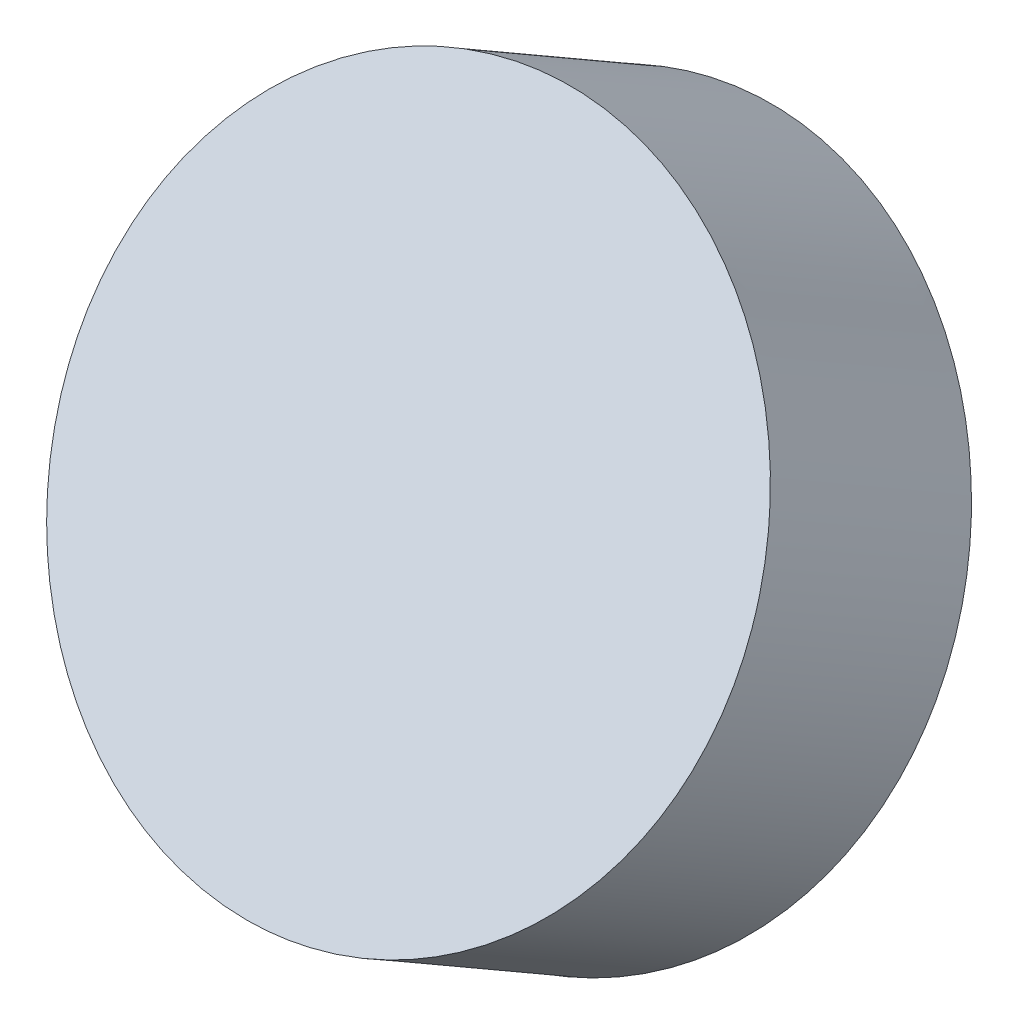
ISO-10303-21;
HEADER;
FILE_DESCRIPTION(('STEP AP214'),'2;1');
FILE_NAME('part.step','',(''),(''),'','','');
FILE_SCHEMA(('AUTOMOTIVE_DESIGN { 1 0 10303 214 1 1 1 1 }'));
ENDSEC;
DATA;
#1=APPLICATION_CONTEXT('core data for automotive mechanical design processes');
#2=APPLICATION_PROTOCOL_DEFINITION('international standard','automotive_design',2000,#1);
#3=PRODUCT_CONTEXT('',#1,'mechanical');
#4=PRODUCT('Part','Part','',(#3));
#5=PRODUCT_RELATED_PRODUCT_CATEGORY('part','',(#4));
#6=PRODUCT_DEFINITION_FORMATION('','',#4);
#7=PRODUCT_DEFINITION_CONTEXT('part definition',#1,'design');
#8=PRODUCT_DEFINITION('design','',#6,#7);
#9=PRODUCT_DEFINITION_SHAPE('','',#8);
#10=(LENGTH_UNIT() NAMED_UNIT(*) SI_UNIT(.MILLI.,.METRE.));
#11=(NAMED_UNIT(*) PLANE_ANGLE_UNIT() SI_UNIT($,.RADIAN.));
#12=(NAMED_UNIT(*) SI_UNIT($,.STERADIAN.) SOLID_ANGLE_UNIT());
#13=UNCERTAINTY_MEASURE_WITH_UNIT(LENGTH_MEASURE(1.E-05),#10,'distance_accuracy_value','');
#14=(GEOMETRIC_REPRESENTATION_CONTEXT(3) GLOBAL_UNCERTAINTY_ASSIGNED_CONTEXT((#13)) GLOBAL_UNIT_ASSIGNED_CONTEXT((#10,
#11,#12)) REPRESENTATION_CONTEXT('',''));
#15=CARTESIAN_POINT('',(0.,0.,0.));
#16=DIRECTION('',(0.,0.,1.));
#17=DIRECTION('',(1.,0.,0.));
#18=AXIS2_PLACEMENT_3D('',#15,#16,#17);
#19=CARTESIAN_POINT('',(12.5,-11.0000300449403,53.9329745870571));
#20=CARTESIAN_POINT('',(12.6682299792076,-11.0000300449403,53.9329745870571));
#21=CARTESIAN_POINT('',(13.0046899376229,-10.9420703881874,53.8995115636287));
#22=CARTESIAN_POINT('',(13.4325454072684,-10.6944876813019,53.7565696211617));
#23=CARTESIAN_POINT('',(13.7184292922025,-10.3239539754408,53.5426418863389));
#24=CARTESIAN_POINT('',(13.8188183624877,-9.88687966842495,53.2902969175275));
#25=CARTESIAN_POINT('',(13.7184292922025,-9.44980536140913,53.037951948716));
#26=CARTESIAN_POINT('',(13.4325454072684,-9.07927165554801,52.8240242138933));
#27=CARTESIAN_POINT('',(13.0046899376229,-8.83168894866253,52.6810822714262));
#28=CARTESIAN_POINT('',(12.5,-8.74474946353318,52.6308877362836));
#29=CARTESIAN_POINT('',(11.9953100623771,-8.83168894866253,52.6810822714262));
#30=CARTESIAN_POINT('',(11.5674545927316,-9.07927165554801,52.8240242138933));
#31=CARTESIAN_POINT('',(11.2815707077975,-9.44980536140913,53.037951948716));
#32=CARTESIAN_POINT('',(11.1811816375123,-9.88687966842495,53.2902969175275));
#33=CARTESIAN_POINT('',(11.2815707077975,-10.3239539754408,53.5426418863389));
#34=CARTESIAN_POINT('',(11.5674545927316,-10.6944876813019,53.7565696211617));
#35=CARTESIAN_POINT('',(11.9953100623771,-10.9420703881874,53.8995115636287));
#36=CARTESIAN_POINT('',(12.3317700207924,-11.0000300449403,53.9329745870571));
#37=CARTESIAN_POINT('',(12.5,-11.0000300449403,53.9329745870571));
#38=B_SPLINE_CURVE_WITH_KNOTS('',3,(#19,#20,#21,#22,#23,#24,#25,#26,#27,#28,#29,#30,#31,#32,#33,
#34,#35,#36,#37),.UNSPECIFIED.,.T.,.F.,(4,1,1,1,1,1,1,1,1,1,1,1,1,1,1,1,4),(0.,
0.0624999999999999,0.124999999999999,0.1875,0.25,0.3125,0.375,0.4375,0.499999999999999,0.5625,
0.625,0.687499999999999,0.75,0.8125,0.875,0.9375,1.),.UNSPECIFIED.);
#39=DIRECTION('',(0.,0.5,0.866025403784438));
#40=VECTOR('',#39,1.);
#41=SURFACE_OF_LINEAR_EXTRUSION('',#38,#40);
#42=CARTESIAN_POINT('',(12.5,-11.0000300449403,53.9329745870571));
#43=CARTESIAN_POINT('',(12.6682299792076,-11.0000300449403,53.9329745870571));
#44=CARTESIAN_POINT('',(13.0046899376229,-10.9420703881874,53.8995115636287));
#45=CARTESIAN_POINT('',(13.4325454072684,-10.6944876813019,53.7565696211617));
#46=CARTESIAN_POINT('',(13.7184292922025,-10.3239539754408,53.5426418863389));
#47=CARTESIAN_POINT('',(13.8188183624877,-9.88687966842495,53.2902969175275));
#48=CARTESIAN_POINT('',(13.7184292922025,-9.44980536140913,53.037951948716));
#49=CARTESIAN_POINT('',(13.4325454072684,-9.07927165554801,52.8240242138932));
#50=CARTESIAN_POINT('',(13.0046899376229,-8.83168894866253,52.6810822714262));
#51=CARTESIAN_POINT('',(12.5,-8.74474946353318,52.6308877362836));
#52=CARTESIAN_POINT('',(11.9953100623771,-8.83168894866253,52.6810822714262));
#53=CARTESIAN_POINT('',(11.5674545927316,-9.07927165554801,52.8240242138932));
#54=CARTESIAN_POINT('',(11.2815707077975,-9.44980536140913,53.037951948716));
#55=CARTESIAN_POINT('',(11.1811816375123,-9.88687966842495,53.2902969175275));
#56=CARTESIAN_POINT('',(11.2815707077975,-10.3239539754408,53.5426418863389));
#57=CARTESIAN_POINT('',(11.5674545927316,-10.6944876813019,53.7565696211617));
#58=CARTESIAN_POINT('',(11.9953100623771,-10.9420703881874,53.8995115636287));
#59=CARTESIAN_POINT('',(12.3317700207924,-11.0000300449403,53.9329745870571));
#60=CARTESIAN_POINT('',(12.5,-11.0000300449403,53.9329745870571));
#61=B_SPLINE_CURVE_WITH_KNOTS('',3,(#42,#43,#44,#45,#46,#47,#48,#49,#50,#51,#52,#53,#54,#55,#56,
#57,#58,#59,#60),.UNSPECIFIED.,.T.,.F.,(4,1,1,1,1,1,1,1,1,1,1,1,1,1,1,1,4),(0.,
0.0624999999999999,0.124999999999999,0.1875,0.25,0.3125,0.375,0.4375,0.499999999999999,0.5625,
0.625,0.687499999999999,0.75,0.8125,0.875,0.9375,1.),.UNSPECIFIED.);
#62=CARTESIAN_POINT('',(12.5,-11.0000300449403,53.9329745870571));
#63=VERTEX_POINT('',#62);
#64=EDGE_CURVE('E10',#63,#63,#61,.T.);
#65=ORIENTED_EDGE('',*,*,#64,.T.);
#66=EDGE_LOOP('',(#65));
#67=FACE_BOUND('',#66,.T.);
#68=CARTESIAN_POINT('',(12.5,-10.5389679238208,54.7315576062815));
#69=CARTESIAN_POINT('',(12.4789707564107,-10.5389679370054,54.7315576138936));
#70=CARTESIAN_POINT('',(12.4579419493091,-10.538515094211,54.7312961649844));
#71=CARTESIAN_POINT('',(12.4159343530486,-10.5367124585186,54.7302554127821));
#72=CARTESIAN_POINT('',(12.394955566905,-10.5353626128519,54.7294760790231));
#73=CARTESIAN_POINT('',(12.3530982075204,-10.5317746122209,54.7274045458929));
#74=CARTESIAN_POINT('',(12.3322196412557,-10.5295363962983,54.7261123113275));
#75=CARTESIAN_POINT('',(12.2906126141021,-10.5241802652808,54.7230199476427));
#76=CARTESIAN_POINT('',(12.2698841597266,-10.5210623122455,54.7212197966185));
#77=CARTESIAN_POINT('',(12.2286273388163,-10.5139552823524,54.7171165509965));
#78=CARTESIAN_POINT('',(12.2080989722815,-10.5099662054944,54.7148134563988));
#79=CARTESIAN_POINT('',(12.167292290748,-10.5011254880216,54.709709265786));
#80=CARTESIAN_POINT('',(12.1470139650022,-10.4962738846179,54.7069081912549));
#81=CARTESIAN_POINT('',(12.1067573569788,-10.4857166816439,54.700812987276));
#82=CARTESIAN_POINT('',(12.0867790542061,-10.4800111407022,54.6975188916774));
#83=CARTESIAN_POINT('',(12.0471724169556,-10.4677546200188,54.6904425861615));
#84=CARTESIAN_POINT('',(12.0275440619585,-10.4612036900334,54.686660404971));
#85=CARTESIAN_POINT('',(11.9886875521215,-10.4472651035171,54.6786129582937));
#86=CARTESIAN_POINT('',(11.9694593972816,-10.4398774469862,54.6743476928069));
#87=CARTESIAN_POINT('',(11.93144586824,-10.4242901029197,54.6653483355142));
#88=CARTESIAN_POINT('',(11.9126605201549,-10.4160903676357,54.6606142161406));
#89=CARTESIAN_POINT('',(11.8755748796246,-10.398903400462,54.6506913160163));
#90=CARTESIAN_POINT('',(11.8572746205572,-10.3899161145651,54.6455025040845));
#91=CARTESIAN_POINT('',(11.8212015232752,-10.3711785584252,54.6346843710032));
#92=CARTESIAN_POINT('',(11.8034287078442,-10.3614282552887,54.6290550308626));
#93=CARTESIAN_POINT('',(11.7684528661265,-10.3411891460979,54.6173699757232));
#94=CARTESIAN_POINT('',(11.7512498398399,-10.3307003400435,54.6113142607242));
#95=CARTESIAN_POINT('',(11.7174559596882,-10.309008693749,54.5987905828969));
#96=CARTESIAN_POINT('',(11.7008650794512,-10.2978058843257,54.5923226378607));
#97=CARTESIAN_POINT('',(11.668337890586,-10.2747107142867,54.5789886352217));
#98=CARTESIAN_POINT('',(11.6524015371157,-10.2628184010444,54.5721226049699));
#99=CARTESIAN_POINT('',(11.6212257453276,-10.2383686752243,54.5580065491861));
#100=CARTESIAN_POINT('',(11.6059862660659,-10.225811301815,54.5507565462679));
#101=CARTESIAN_POINT('',(11.5762467809678,-10.2000561522247,54.5358868037189));
#102=CARTESIAN_POINT('',(11.5617467751315,-10.1868583760435,54.528267064088));
#103=CARTESIAN_POINT('',(11.5335146635638,-10.1598593483719,54.512679168194));
#104=CARTESIAN_POINT('',(11.5197826030603,-10.146058061423,54.5047109914589));
#105=CARTESIAN_POINT('',(11.4931145977823,-10.117888689552,54.4884473970262));
#106=CARTESIAN_POINT('',(11.4801787077099,-10.1035205657956,54.4801519569077));
#107=CARTESIAN_POINT('',(11.4551313520553,-10.0742542070918,54.4632550168319));
#108=CARTESIAN_POINT('',(11.4430199220574,-10.0593559493056,54.4546535036886));
#109=CARTESIAN_POINT('',(11.4196498117784,-10.0290659818594,54.4371655828298));
#110=CARTESIAN_POINT('',(11.4083911314974,-10.0136742721994,54.4282791751143));
#111=CARTESIAN_POINT('',(11.3867548653347,-9.98243405355985,54.4102426264732));
#112=CARTESIAN_POINT('',(11.376377241471,-9.96658556431131,54.4010924969393));
#113=CARTESIAN_POINT('',(11.3565314412224,-9.93446845749728,54.3825496766746));
#114=CARTESIAN_POINT('',(11.3470632024752,-9.9181998688378,54.3731570026327));
#115=CARTESIAN_POINT('',(11.32906448789,-9.8852791869972,54.3541502381101));
#116=CARTESIAN_POINT('',(11.3205339569167,-9.86862711643371,54.3445361606877));
#117=CARTESIAN_POINT('',(11.3044390635613,-9.83497639182406,54.3251079057759));
#118=CARTESIAN_POINT('',(11.2968747011792,-9.8179777377779,54.3152937282865));
#119=CARTESIAN_POINT('',(11.2827220901504,-9.78367738371719,54.2954904096363));
#120=CARTESIAN_POINT('',(11.2761338989574,-9.76637566593242,54.2855012582158));
#121=CARTESIAN_POINT('',(11.2639434909883,-9.73151242087553,54.2653729542974));
#122=CARTESIAN_POINT('',(11.2583413419106,-9.7139508758542,54.2552337915519));
#123=CARTESIAN_POINT('',(11.2481329607271,-9.67861125239898,54.234830450437));
#124=CARTESIAN_POINT('',(11.2435267715891,-9.66083316465793,54.224566266694));
#125=CARTESIAN_POINT('',(11.2353202801882,-9.6251037119208,54.2039378575382));
#126=CARTESIAN_POINT('',(11.2317199779253,-9.60715234692473,54.1935736321254));
#127=CARTESIAN_POINT('',(11.2255352511417,-9.57111959603466,54.1727701136994));
#128=CARTESIAN_POINT('',(11.2229507828111,-9.55303821578206,54.1623308239433));
#129=CARTESIAN_POINT('',(11.2188077143643,-9.5167887105631,54.1414021623471));
#130=CARTESIAN_POINT('',(11.2172490438598,-9.49862059163476,54.1309127939931));
#131=CARTESIAN_POINT('',(11.2151675476143,-9.46224082915718,54.1099089283337));
#132=CARTESIAN_POINT('',(11.2146446609407,-9.44402918823134,54.0993944325427));
#133=CARTESIAN_POINT('',(11.2146446609407,-9.40760590637967,54.0783654409609));
#134=CARTESIAN_POINT('',(11.2151675476143,-9.38939426545383,54.06785094517));
#135=CARTESIAN_POINT('',(11.2172490438598,-9.35301450297625,54.0468470795105));
#136=CARTESIAN_POINT('',(11.2188077143643,-9.33484638404791,54.0363577111566));
#137=CARTESIAN_POINT('',(11.2229507828111,-9.29859687882895,54.0154290495604));
#138=CARTESIAN_POINT('',(11.2255352511417,-9.28051549857635,54.0049897598043));
#139=CARTESIAN_POINT('',(11.2317199779253,-9.24448274768629,53.9841862413782));
#140=CARTESIAN_POINT('',(11.2353202801882,-9.22653138269021,53.9738220159654));
#141=CARTESIAN_POINT('',(11.2435267715891,-9.19080192995309,53.9531936068096));
#142=CARTESIAN_POINT('',(11.2481329607271,-9.17302384221203,53.9429294230667));
#143=CARTESIAN_POINT('',(11.2583413419106,-9.13768421875681,53.9225260819517));
#144=CARTESIAN_POINT('',(11.2639434909883,-9.12012267373549,53.9123869192063));
#145=CARTESIAN_POINT('',(11.2761338989574,-9.0852594286786,53.8922586152879));
#146=CARTESIAN_POINT('',(11.2827220901504,-9.06795771089383,53.8822694638674));
#147=CARTESIAN_POINT('',(11.2968747011792,-9.03365735683311,53.8624661452171));
#148=CARTESIAN_POINT('',(11.3044390635613,-9.01665870278696,53.8526519677277));
#149=CARTESIAN_POINT('',(11.3205339569167,-8.98300797817731,53.8332237128159));
#150=CARTESIAN_POINT('',(11.32906448789,-8.96635590761382,53.8236096353935));
#151=CARTESIAN_POINT('',(11.3470632024752,-8.93343522577321,53.8046028708709));
#152=CARTESIAN_POINT('',(11.3565314412224,-8.91716663711374,53.7952101968291));
#153=CARTESIAN_POINT('',(11.376377241471,-8.88504953029971,53.7766673765644));
#154=CARTESIAN_POINT('',(11.3867548653347,-8.86920104105117,53.7675172470305));
#155=CARTESIAN_POINT('',(11.4083911314974,-8.83796082241157,53.7494806983894));
#156=CARTESIAN_POINT('',(11.4196498117784,-8.8225691127516,53.7405942906739));
#157=CARTESIAN_POINT('',(11.4430199220574,-8.79227914530541,53.7231063698151));
#158=CARTESIAN_POINT('',(11.4551313520553,-8.77738088751918,53.7145048566718));
#159=CARTESIAN_POINT('',(11.4801787077099,-8.74811452881537,53.6976079165959));
#160=CARTESIAN_POINT('',(11.4931145977823,-8.73374640505902,53.6893124764774));
#161=CARTESIAN_POINT('',(11.5197826030603,-8.70557703318801,53.6730488820448));
#162=CARTESIAN_POINT('',(11.5335146635638,-8.69177574623908,53.6650807053097));
#163=CARTESIAN_POINT('',(11.5617467751315,-8.66477671856749,53.6494928094156));
#164=CARTESIAN_POINT('',(11.5762467809678,-8.65157894238636,53.6418730697848));
#165=CARTESIAN_POINT('',(11.6059862660659,-8.62582379279597,53.6270033272357));
#166=CARTESIAN_POINT('',(11.6212257453276,-8.61326641938672,53.6197533243176));
#167=CARTESIAN_POINT('',(11.6524015371157,-8.5888166935666,53.6056372685337));
#168=CARTESIAN_POINT('',(11.668337890586,-8.57692438032427,53.598771238282));
#169=CARTESIAN_POINT('',(11.7008650794512,-8.55382921028531,53.585437235643));
#170=CARTESIAN_POINT('',(11.7174559596882,-8.54262640086201,53.5789692906068));
#171=CARTESIAN_POINT('',(11.7512498398399,-8.52093475456747,53.5664456127795));
#172=CARTESIAN_POINT('',(11.7684528661265,-8.51044594851314,53.5603898977805));
#173=CARTESIAN_POINT('',(11.8034287078442,-8.49020683932232,53.548704842641));
#174=CARTESIAN_POINT('',(11.8212015232751,-8.48045653618583,53.5430755025005));
#175=CARTESIAN_POINT('',(11.8572746205573,-8.4617189800459,53.5322573694192));
#176=CARTESIAN_POINT('',(11.8755748796251,-8.45273169414905,53.5270685574873));
#177=CARTESIAN_POINT('',(11.9126605201545,-8.4355447269753,53.517145657363));
#178=CARTESIAN_POINT('',(11.9314458682382,-8.4273449916912,53.5124115379895));
#179=CARTESIAN_POINT('',(11.9694593972834,-8.41175764762494,53.5034121806969));
#180=CARTESIAN_POINT('',(11.9886875521282,-8.40436999109427,53.4991469152102));
#181=CARTESIAN_POINT('',(12.0275440619518,-8.39043140457726,53.4910994685325));
#182=CARTESIAN_POINT('',(12.0471724169306,-8.38388047459094,53.4873172873414));
#183=CARTESIAN_POINT('',(12.0867790542311,-8.3716239539101,53.480240981827));
#184=CARTESIAN_POINT('',(12.1067573570721,-8.36591841297198,53.4769468862305));
#185=CARTESIAN_POINT('',(12.1470139649089,-8.35536120998828,53.470851682246));
#186=CARTESIAN_POINT('',(12.1672922903998,-8.3505096065712,53.4680506077071));
#187=CARTESIAN_POINT('',(12.2080989726297,-8.34166888913479,53.4629464171154));
#188=CARTESIAN_POINT('',(12.2286273401156,-8.33767981232661,53.4606433225464));
#189=CARTESIAN_POINT('',(12.2698841584272,-8.33057278229749,53.4565400768459));
#190=CARTESIAN_POINT('',(12.2906126092528,-8.32745482907655,53.4547399257145));
#191=CARTESIAN_POINT('',(12.3322196461048,-8.32209869856642,53.4516475623227));
#192=CARTESIAN_POINT('',(12.3530982256172,-8.31986048333693,53.4503553281574));
#193=CARTESIAN_POINT('',(12.3949555488095,-8.31627248081238,53.448283793934));
#194=CARTESIAN_POINT('',(12.4159342855174,-8.31492263255934,53.4475044586817));
#195=CARTESIAN_POINT('',(12.4579420168363,-8.31312000393287,53.446463710559));
#196=CARTESIAN_POINT('',(12.4789710084182,-8.31266717079018,53.4462022672222));
#197=CARTESIAN_POINT('',(12.5210289915818,-8.31266717079018,53.4462022672222));
#198=CARTESIAN_POINT('',(12.5420579831637,-8.31312000393287,53.446463710559));
#199=CARTESIAN_POINT('',(12.5840657144826,-8.31492263255934,53.4475044586817));
#200=CARTESIAN_POINT('',(12.6050444511905,-8.31627248081238,53.448283793934));
#201=CARTESIAN_POINT('',(12.6469017743828,-8.31986048333693,53.4503553281574));
#202=CARTESIAN_POINT('',(12.6677803538952,-8.32209869856642,53.4516475623227));
#203=CARTESIAN_POINT('',(12.7093873907472,-8.32745482907655,53.4547399257145));
#204=CARTESIAN_POINT('',(12.7301158415728,-8.33057278229749,53.4565400768459));
#205=CARTESIAN_POINT('',(12.7713726598844,-8.33767981232661,53.4606433225464));
#206=CARTESIAN_POINT('',(12.7919010273703,-8.34166888913479,53.4629464171154));
#207=CARTESIAN_POINT('',(12.8327077096002,-8.3505096065712,53.4680506077071));
#208=CARTESIAN_POINT('',(12.8529860350911,-8.35536120998827,53.470851682246));
#209=CARTESIAN_POINT('',(12.8932426429279,-8.36591841297197,53.4769468862305));
#210=CARTESIAN_POINT('',(12.9132209457689,-8.3716239539101,53.480240981827));
#211=CARTESIAN_POINT('',(12.9528275830694,-8.38388047459094,53.4873172873414));
#212=CARTESIAN_POINT('',(12.9724559380482,-8.39043140457726,53.4910994685325));
#213=CARTESIAN_POINT('',(13.0113124478718,-8.40436999109427,53.4991469152102));
#214=CARTESIAN_POINT('',(13.0305406027166,-8.41175764762494,53.5034121806968));
#215=CARTESIAN_POINT('',(13.0685541317618,-8.4273449916912,53.5124115379894));
#216=CARTESIAN_POINT('',(13.0873394798455,-8.43554472697529,53.517145657363));
#217=CARTESIAN_POINT('',(13.1244251203749,-8.45273169414905,53.5270685574873));
#218=CARTESIAN_POINT('',(13.1427253794427,-8.4617189800459,53.5322573694192));
#219=CARTESIAN_POINT('',(13.1787984767249,-8.48045653618583,53.5430755025005));
#220=CARTESIAN_POINT('',(13.1965712921558,-8.49020683932232,53.548704842641));
#221=CARTESIAN_POINT('',(13.2315471338735,-8.51044594851314,53.5603898977805));
#222=CARTESIAN_POINT('',(13.2487501601601,-8.52093475456746,53.5664456127795));
#223=CARTESIAN_POINT('',(13.2825440403118,-8.54262640086201,53.5789692906068));
#224=CARTESIAN_POINT('',(13.2991349205488,-8.5538292102853,53.585437235643));
#225=CARTESIAN_POINT('',(13.331662109414,-8.57692438032427,53.598771238282));
#226=CARTESIAN_POINT('',(13.3475984628843,-8.5888166935666,53.6056372685337));
#227=CARTESIAN_POINT('',(13.3787742546724,-8.61326641938672,53.6197533243176));
#228=CARTESIAN_POINT('',(13.3940137339341,-8.62582379279597,53.6270033272357));
#229=CARTESIAN_POINT('',(13.4237532190322,-8.65157894238635,53.6418730697847));
#230=CARTESIAN_POINT('',(13.4382532248685,-8.66477671856749,53.6494928094156));
#231=CARTESIAN_POINT('',(13.4664853364362,-8.69177574623908,53.6650807053097));
#232=CARTESIAN_POINT('',(13.4802173969397,-8.70557703318801,53.6730488820448));
#233=CARTESIAN_POINT('',(13.5068854022177,-8.73374640505902,53.6893124764775));
#234=CARTESIAN_POINT('',(13.5198212922901,-8.74811452881537,53.6976079165959));
#235=CARTESIAN_POINT('',(13.5448686479447,-8.77738088751917,53.7145048566718));
#236=CARTESIAN_POINT('',(13.5569800779426,-8.7922791453054,53.7231063698151));
#237=CARTESIAN_POINT('',(13.5803501882216,-8.82256911275159,53.7405942906739));
#238=CARTESIAN_POINT('',(13.5916088685026,-8.83796082241156,53.7494806983894));
#239=CARTESIAN_POINT('',(13.6132451346653,-8.86920104105117,53.7675172470305));
#240=CARTESIAN_POINT('',(13.623622758529,-8.8850495302997,53.7766673765644));
#241=CARTESIAN_POINT('',(13.6434685587776,-8.91716663711373,53.7952101968291));
#242=CARTESIAN_POINT('',(13.6529367975248,-8.93343522577321,53.8046028708709));
#243=CARTESIAN_POINT('',(13.67093551211,-8.96635590761381,53.8236096353935));
#244=CARTESIAN_POINT('',(13.6794660430833,-8.9830079781773,53.8332237128159));
#245=CARTESIAN_POINT('',(13.6955609364387,-9.01665870278695,53.8526519677277));
#246=CARTESIAN_POINT('',(13.7031252988208,-9.03365735683311,53.8624661452171));
#247=CARTESIAN_POINT('',(13.7172779098496,-9.06795771089382,53.8822694638674));
#248=CARTESIAN_POINT('',(13.7238661010426,-9.08525942867859,53.8922586152879));
#249=CARTESIAN_POINT('',(13.7360565090117,-9.12012267373548,53.9123869192063));
#250=CARTESIAN_POINT('',(13.7416586580894,-9.13768421875681,53.9225260819517));
#251=CARTESIAN_POINT('',(13.7518670392729,-9.17302384221203,53.9429294230667));
#252=CARTESIAN_POINT('',(13.7564732284109,-9.19080192995308,53.9531936068096));
#253=CARTESIAN_POINT('',(13.7646797198118,-9.22653138269021,53.9738220159654));
#254=CARTESIAN_POINT('',(13.7682800220747,-9.24448274768628,53.9841862413782));
#255=CARTESIAN_POINT('',(13.7744647488583,-9.28051549857635,54.0049897598043));
#256=CARTESIAN_POINT('',(13.7770492171889,-9.29859687882895,54.0154290495604));
#257=CARTESIAN_POINT('',(13.7811922856357,-9.33484638404791,54.0363577111566));
#258=CARTESIAN_POINT('',(13.7827509561402,-9.35301450297625,54.0468470795105));
#259=CARTESIAN_POINT('',(13.7848324523857,-9.38939426545383,54.06785094517));
#260=CARTESIAN_POINT('',(13.7853553390593,-9.40760590637966,54.0783654409609));
#261=CARTESIAN_POINT('',(13.7853553390593,-9.44402918823134,54.0993944325428));
#262=CARTESIAN_POINT('',(13.7848324523857,-9.46224082915717,54.1099089283337));
#263=CARTESIAN_POINT('',(13.7827509561402,-9.49862059163475,54.1309127939932));
#264=CARTESIAN_POINT('',(13.7811922856357,-9.51678871056309,54.1414021623471));
#265=CARTESIAN_POINT('',(13.7770492171889,-9.55303821578206,54.1623308239433));
#266=CARTESIAN_POINT('',(13.7744647488584,-9.57111959603465,54.1727701136994));
#267=CARTESIAN_POINT('',(13.7682800220747,-9.60715234692472,54.1935736321254));
#268=CARTESIAN_POINT('',(13.7646797198118,-9.6251037119208,54.2039378575383));
#269=CARTESIAN_POINT('',(13.7564732284109,-9.66083316465792,54.224566266694));
#270=CARTESIAN_POINT('',(13.7518670392729,-9.67861125239898,54.234830450437));
#271=CARTESIAN_POINT('',(13.7416586580894,-9.7139508758542,54.2552337915519));
#272=CARTESIAN_POINT('',(13.7360565090117,-9.73151242087553,54.2653729542974));
#273=CARTESIAN_POINT('',(13.7238661010426,-9.76637566593241,54.2855012582158));
#274=CARTESIAN_POINT('',(13.7172779098496,-9.78367738371718,54.2954904096363));
#275=CARTESIAN_POINT('',(13.7031252988208,-9.8179777377779,54.3152937282865));
#276=CARTESIAN_POINT('',(13.6955609364387,-9.83497639182406,54.3251079057759));
#277=CARTESIAN_POINT('',(13.6794660430833,-9.86862711643371,54.3445361606877));
#278=CARTESIAN_POINT('',(13.67093551211,-9.8852791869972,54.3541502381101));
#279=CARTESIAN_POINT('',(13.6529367975248,-9.9181998688378,54.3731570026327));
#280=CARTESIAN_POINT('',(13.6434685587776,-9.93446845749728,54.3825496766746));
#281=CARTESIAN_POINT('',(13.623622758529,-9.96658556431131,54.4010924969393));
#282=CARTESIAN_POINT('',(13.6132451346653,-9.98243405355984,54.4102426264732));
#283=CARTESIAN_POINT('',(13.5916088685026,-10.0136742721994,54.4282791751143));
#284=CARTESIAN_POINT('',(13.5803501882216,-10.0290659818594,54.4371655828297));
#285=CARTESIAN_POINT('',(13.5569800779426,-10.0593559493056,54.4546535036885));
#286=CARTESIAN_POINT('',(13.5448686479447,-10.0742542070918,54.4632550168319));
#287=CARTESIAN_POINT('',(13.5198212922901,-10.1035205657956,54.4801519569077));
#288=CARTESIAN_POINT('',(13.5068854022177,-10.117888689552,54.4884473970262));
#289=CARTESIAN_POINT('',(13.4802173969397,-10.146058061423,54.5047109914588));
#290=CARTESIAN_POINT('',(13.4664853364362,-10.1598593483719,54.512679168194));
#291=CARTESIAN_POINT('',(13.4382532248685,-10.1868583760435,54.528267064088));
#292=CARTESIAN_POINT('',(13.4237532190322,-10.2000561522247,54.5358868037189));
#293=CARTESIAN_POINT('',(13.3940137339341,-10.225811301815,54.5507565462679));
#294=CARTESIAN_POINT('',(13.3787742546724,-10.2383686752243,54.5580065491861));
#295=CARTESIAN_POINT('',(13.3475984628843,-10.2628184010444,54.5721226049699));
#296=CARTESIAN_POINT('',(13.331662109414,-10.2747107142867,54.5789886352217));
#297=CARTESIAN_POINT('',(13.2991349205488,-10.2978058843257,54.5923226378606));
#298=CARTESIAN_POINT('',(13.2825440403118,-10.309008693749,54.5987905828969));
#299=CARTESIAN_POINT('',(13.2487501601601,-10.3307003400435,54.6113142607242));
#300=CARTESIAN_POINT('',(13.2315471338735,-10.3411891460979,54.6173699757231));
#301=CARTESIAN_POINT('',(13.1965712921558,-10.3614282552887,54.6290550308626));
#302=CARTESIAN_POINT('',(13.1787984767248,-10.3711785584252,54.6346843710031));
#303=CARTESIAN_POINT('',(13.1427253794428,-10.3899161145651,54.6455025040845));
#304=CARTESIAN_POINT('',(13.1244251203754,-10.398903400462,54.6506913160163));
#305=CARTESIAN_POINT('',(13.0873394798451,-10.4160903676357,54.6606142161406));
#306=CARTESIAN_POINT('',(13.06855413176,-10.4242901029197,54.6653483355141));
#307=CARTESIAN_POINT('',(13.0305406027184,-10.4398774469862,54.6743476928069));
#308=CARTESIAN_POINT('',(13.0113124478785,-10.4472651035171,54.6786129582937));
#309=CARTESIAN_POINT('',(12.9724559380415,-10.4612036900334,54.686660404971));
#310=CARTESIAN_POINT('',(12.9528275830444,-10.4677546200188,54.6904425861615));
#311=CARTESIAN_POINT('',(12.9132209457939,-10.4800111407022,54.6975188916774));
#312=CARTESIAN_POINT('',(12.8932426430212,-10.4857166816439,54.700812987276));
#313=CARTESIAN_POINT('',(12.8529860349978,-10.4962738846179,54.7069081912549));
#314=CARTESIAN_POINT('',(12.832707709252,-10.5011254880216,54.709709265786));
#315=CARTESIAN_POINT('',(12.7919010277185,-10.5099662054944,54.7148134563988));
#316=CARTESIAN_POINT('',(12.7713726611837,-10.5139552823524,54.7171165509965));
#317=CARTESIAN_POINT('',(12.7301158402735,-10.5210623122455,54.7212197966185));
#318=CARTESIAN_POINT('',(12.7093873858979,-10.5241802652808,54.7230199476427));
#319=CARTESIAN_POINT('',(12.6677803587443,-10.5295363962983,54.7261123113275));
#320=CARTESIAN_POINT('',(12.6469017924796,-10.5317746122209,54.7274045458929));
#321=CARTESIAN_POINT('',(12.605044433095,-10.5353626128519,54.7294760790231));
#322=CARTESIAN_POINT('',(12.5840656469515,-10.5367124585186,54.7302554127821));
#323=CARTESIAN_POINT('',(12.5420580506909,-10.538515094211,54.7312961649844));
#324=CARTESIAN_POINT('',(12.5210292435893,-10.5389679370054,54.7315576138936));
#325=CARTESIAN_POINT('',(12.5,-10.5389679238208,54.7315576062815));
#326=B_SPLINE_CURVE_WITH_KNOTS('',3,(#68,#69,#70,#71,#72,#73,#74,#75,#76,#77,#78,#79,#80,#81,
#82,#83,#84,#85,#86,#87,#88,#89,#90,#91,#92,#93,#94,#95,#96,#97,#98,#99,#100,#101,#102,#103,
#104,#105,#106,#107,#108,#109,#110,#111,#112,#113,#114,#115,#116,#117,#118,#119,#120,#121,#122,
#123,#124,#125,#126,#127,#128,#129,#130,#131,#132,#133,#134,#135,#136,#137,#138,#139,#140,#141,
#142,#143,#144,#145,#146,#147,#148,#149,#150,#151,#152,#153,#154,#155,#156,#157,#158,#159,#160,
#161,#162,#163,#164,#165,#166,#167,#168,#169,#170,#171,#172,#173,#174,#175,#176,#177,#178,#179,
#180,#181,#182,#183,#184,#185,#186,#187,#188,#189,#190,#191,#192,#193,#194,#195,#196,#197,#198,
#199,#200,#201,#202,#203,#204,#205,#206,#207,#208,#209,#210,#211,#212,#213,#214,#215,#216,#217,
#218,#219,#220,#221,#222,#223,#224,#225,#226,#227,#228,#229,#230,#231,#232,#233,#234,#235,#236,
#237,#238,#239,#240,#241,#242,#243,#244,#245,#246,#247,#248,#249,#250,#251,#252,#253,#254,#255,
#256,#257,#258,#259,#260,#261,#262,#263,#264,#265,#266,#267,#268,#269,#270,#271,#272,#273,#274,
#275,#276,#277,#278,#279,#280,#281,#282,#283,#284,#285,#286,#287,#288,#289,#290,#291,#292,#293,
#294,#295,#296,#297,#298,#299,#300,#301,#302,#303,#304,#305,#306,#307,#308,#309,#310,#311,#312,
#313,#314,#315,#316,#317,#318,#319,#320,#321,#322,#323,#324,#325),.UNSPECIFIED.,.F.,.F.,(4,2,2,
2,2,2,2,2,2,2,2,2,2,2,2,2,2,2,2,2,2,2,2,2,2,2,2,2,2,2,2,2,2,2,2,2,2,2,2,2,2,2,2,2,2,2,2,2,2,2,2,
2,2,2,2,2,2,2,2,2,2,2,2,2,2,2,2,2,2,2,2,2,2,2,2,2,2,2,2,2,2,2,2,2,2,2,2,2,2,2,2,2,2,2,2,2,2,2,2,
2,2,2,2,2,2,2,2,2,2,2,2,2,2,2,2,2,2,2,2,2,2,2,2,2,2,2,2,2,4),(0.,0.0630806127990794,
0.126164936809588,0.189253590290846,0.252344965001653,0.315436339712459,0.378524993193716,
0.44160931720423,0.504689930003309,0.567770542802382,0.630854866812896,0.693943520294154,
0.757034895004958,0.82012626971576,0.883214923197022,0.946299247207532,1.00937986000661,
1.07246047280569,1.1355447968162,1.19863345029746,1.26172482500826,1.32481619971907,
1.38790485320033,1.45098917721084,1.51406979000992,1.577150402809,1.64023472681951,
1.70332338030077,1.76641475501157,1.82950612972238,1.89259478320363,1.95567910721415,
2.01875972001322,2.0818403328123,2.14492465682281,2.20801331030407,2.27110468501487,
2.33419605972568,2.39728471320694,2.46036903721745,2.52344965001653,2.5865302628156,
2.64961458682611,2.71270324030737,2.77579461501818,2.83888598972898,2.90197464321024,
2.96505896722075,3.02813958001983,3.0912201928189,3.15430451682941,3.21739317031067,
3.28048454502148,3.34357591973229,3.40666457321354,3.46974889722406,3.53282951002313,
3.59591012282221,3.65899444683272,3.72208310031398,3.78517447502479,3.84826584973559,
3.91135450321685,3.97443882722736,4.03751944002644,4.10060005282551,4.16368437683603,
4.22677303031728,4.28986440502809,4.35295577973889,4.41604443322015,4.47912875723066,
4.54220937002974,4.60528998282881,4.66837430683932,4.73146296032058,4.79455433503139,
4.8576457097422,4.92073436322346,4.98381868723397,5.04689930003304,5.10997991283212,
5.17306423684263,5.23615289032389,5.29924426503469,5.36233563974551,5.42542429322676,
5.48850861723727,5.55158923003635,5.61466984283542,5.67775416684594,5.74084282032719,
5.803934195038,5.8670255697488,5.93011422323006,5.99319854724058,6.05627916003965,
6.11935977283874,6.18244409684924,6.2455327503305,6.30862412504131,6.37171549975212,
6.43480415323337,6.49788847724388,6.56096909004296,6.62404970284204,6.68713402685255,
6.75022268033381,6.81331405504461,6.87640542975541,6.93949408323667,7.00257840724718,
7.06565902004626,7.12873963284533,7.19182395685584,7.2549126103371,7.31800398504791,
7.38109535975871,7.44418401323997,7.50726833725048,7.57034895004956,7.63342956284864,
7.69651388685915,7.75960254034041,7.82269391505121,7.88578528976202,7.94887394324328,
8.01195826725379,8.07503888005286),.UNSPECIFIED.);
#327=CARTESIAN_POINT('',(12.5,-10.5389679238208,54.7315576062815));
#328=VERTEX_POINT('',#327);
#329=EDGE_CURVE('E25',#328,#328,#326,.F.);
#330=ORIENTED_EDGE('',*,*,#329,.F.);
#331=EDGE_LOOP('',(#330));
#332=FACE_BOUND('',#331,.T.);
#333=ADVANCED_FACE('F15',(#67,#332),#41,.T.);
#334=CARTESIAN_POINT('',(-13.7495895867941,0.969446799073534,47.0223939091068));
#335=DIRECTION('',(0.,0.5,0.866025403784438));
#336=DIRECTION('',(-1.,0.,0.));
#337=AXIS2_PLACEMENT_3D('',#334,#335,#336);
#338=PLANE('',#337);
#339=ORIENTED_EDGE('',*,*,#64,.F.);
#340=EDGE_LOOP('',(#339));
#341=FACE_BOUND('',#340,.T.);
#342=ADVANCED_FACE('F63',(#341),#338,.F.);
#343=CARTESIAN_POINT('',(-13.7495895867941,1.43050892019299,47.8209769283311));
#344=DIRECTION('',(0.,0.5,0.866025403784438));
#345=DIRECTION('',(-1.,0.,0.));
#346=AXIS2_PLACEMENT_3D('',#343,#344,#345);
#347=PLANE('',#346);
#348=ORIENTED_EDGE('',*,*,#329,.T.);
#349=EDGE_LOOP('',(#348));
#350=FACE_BOUND('',#349,.T.);
#351=ADVANCED_FACE('F32',(#350),#347,.T.);
#352=CLOSED_SHELL('',(#333,#342,#351));
#353=MANIFOLD_SOLID_BREP('B1',#352);
#354=ADVANCED_BREP_SHAPE_REPRESENTATION('',(#18,#353),#14);
#355=SHAPE_DEFINITION_REPRESENTATION(#9,#354);
ENDSEC;
END-ISO-10303-21;
